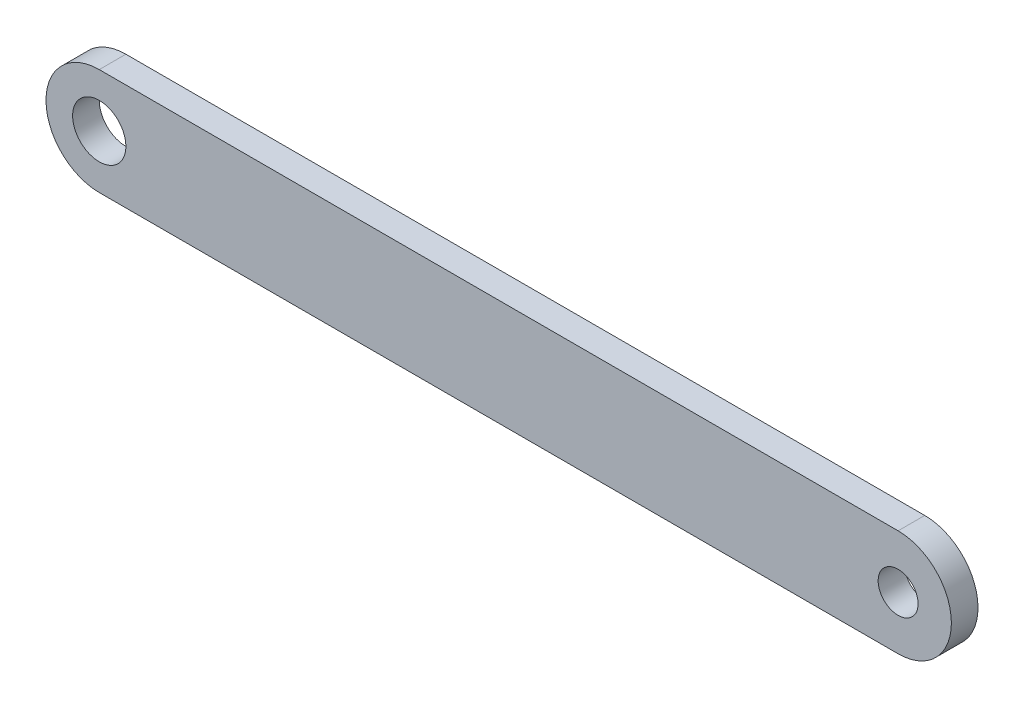
ISO-10303-21;
HEADER;
FILE_DESCRIPTION(('STEP AP214'),'2;1');
FILE_NAME('part.step','',(''),(''),'','','');
FILE_SCHEMA(('AUTOMOTIVE_DESIGN { 1 0 10303 214 1 1 1 1 }'));
ENDSEC;
DATA;
#1=APPLICATION_CONTEXT('core data for automotive mechanical design processes');
#2=APPLICATION_PROTOCOL_DEFINITION('international standard','automotive_design',2000,#1);
#3=PRODUCT_CONTEXT('',#1,'mechanical');
#4=PRODUCT('Part','Part','',(#3));
#5=PRODUCT_RELATED_PRODUCT_CATEGORY('part','',(#4));
#6=PRODUCT_DEFINITION_FORMATION('','',#4);
#7=PRODUCT_DEFINITION_CONTEXT('part definition',#1,'design');
#8=PRODUCT_DEFINITION('design','',#6,#7);
#9=PRODUCT_DEFINITION_SHAPE('','',#8);
#10=(LENGTH_UNIT() NAMED_UNIT(*) SI_UNIT(.MILLI.,.METRE.));
#11=(NAMED_UNIT(*) PLANE_ANGLE_UNIT() SI_UNIT($,.RADIAN.));
#12=(NAMED_UNIT(*) SI_UNIT($,.STERADIAN.) SOLID_ANGLE_UNIT());
#13=UNCERTAINTY_MEASURE_WITH_UNIT(LENGTH_MEASURE(1.E-05),#10,'distance_accuracy_value','');
#14=(GEOMETRIC_REPRESENTATION_CONTEXT(3) GLOBAL_UNCERTAINTY_ASSIGNED_CONTEXT((#13)) GLOBAL_UNIT_ASSIGNED_CONTEXT((#10,
#11,#12)) REPRESENTATION_CONTEXT('',''));
#15=CARTESIAN_POINT('',(0.,0.,0.));
#16=DIRECTION('',(0.,0.,1.));
#17=DIRECTION('',(1.,0.,0.));
#18=AXIS2_PLACEMENT_3D('',#15,#16,#17);
#19=CARTESIAN_POINT('',(-150.,0.,5.));
#20=DIRECTION('',(0.,0.,-1.));
#21=DIRECTION('',(-1.,0.,0.));
#22=AXIS2_PLACEMENT_3D('',#19,#20,#21);
#23=CYLINDRICAL_SURFACE('',#22,20.);
#24=CARTESIAN_POINT('',(-150.,0.,-5.));
#25=DIRECTION('',(0.,0.,1.));
#26=DIRECTION('',(1.,0.,0.));
#27=AXIS2_PLACEMENT_3D('',#24,#25,#26);
#28=CIRCLE('',#27,20.);
#29=CARTESIAN_POINT('',(-150.,20.,-5.));
#30=VERTEX_POINT('',#29);
#31=CARTESIAN_POINT('',(-150.,-20.,-5.));
#32=VERTEX_POINT('',#31);
#33=EDGE_CURVE('E111',#30,#32,#28,.T.);
#34=ORIENTED_EDGE('',*,*,#33,.T.);
#35=DIRECTION('',(0.,0.,-1.));
#36=VECTOR('',#35,1.);
#37=CARTESIAN_POINT('',(-150.,-20.,5.));
#38=LINE('',#37,#36);
#39=CARTESIAN_POINT('',(-150.,-20.,5.));
#40=VERTEX_POINT('',#39);
#41=EDGE_CURVE('E11',#40,#32,#38,.T.);
#42=ORIENTED_EDGE('',*,*,#41,.F.);
#43=CARTESIAN_POINT('',(-150.,0.,5.));
#44=DIRECTION('',(0.,0.,1.));
#45=DIRECTION('',(1.,0.,0.));
#46=AXIS2_PLACEMENT_3D('',#43,#44,#45);
#47=CIRCLE('',#46,20.);
#48=CARTESIAN_POINT('',(-150.,20.,5.));
#49=VERTEX_POINT('',#48);
#50=EDGE_CURVE('E95',#49,#40,#47,.T.);
#51=ORIENTED_EDGE('',*,*,#50,.F.);
#52=DIRECTION('',(0.,0.,-1.));
#53=VECTOR('',#52,1.);
#54=CARTESIAN_POINT('',(-150.,20.,5.));
#55=LINE('',#54,#53);
#56=EDGE_CURVE('E107',#49,#30,#55,.T.);
#57=ORIENTED_EDGE('',*,*,#56,.T.);
#58=EDGE_LOOP('',(#34,#42,#51,#57));
#59=FACE_BOUND('',#58,.T.);
#60=ADVANCED_FACE('F43',(#59),#23,.T.);
#61=CARTESIAN_POINT('',(-150.,-20.,5.));
#62=DIRECTION('',(0.,1.,0.));
#63=DIRECTION('',(-1.,0.,0.));
#64=AXIS2_PLACEMENT_3D('',#61,#62,#63);
#65=PLANE('',#64);
#66=DIRECTION('',(1.,0.,0.));
#67=VECTOR('',#66,1.);
#68=CARTESIAN_POINT('',(-150.,-20.,-5.));
#69=LINE('',#68,#67);
#70=CARTESIAN_POINT('',(150.,-19.9999999999999,-5.));
#71=VERTEX_POINT('',#70);
#72=EDGE_CURVE('E100',#32,#71,#69,.T.);
#73=ORIENTED_EDGE('',*,*,#72,.T.);
#74=DIRECTION('',(0.,0.,-1.));
#75=VECTOR('',#74,1.);
#76=CARTESIAN_POINT('',(150.,-19.9999999999999,5.));
#77=LINE('',#76,#75);
#78=CARTESIAN_POINT('',(150.,-19.9999999999999,5.));
#79=VERTEX_POINT('',#78);
#80=EDGE_CURVE('E52',#79,#71,#77,.T.);
#81=ORIENTED_EDGE('',*,*,#80,.F.);
#82=DIRECTION('',(1.,0.,0.));
#83=VECTOR('',#82,1.);
#84=CARTESIAN_POINT('',(-150.,-20.,5.));
#85=LINE('',#84,#83);
#86=EDGE_CURVE('E90',#40,#79,#85,.T.);
#87=ORIENTED_EDGE('',*,*,#86,.F.);
#88=ORIENTED_EDGE('',*,*,#41,.T.);
#89=EDGE_LOOP('',(#73,#81,#87,#88));
#90=FACE_BOUND('',#89,.T.);
#91=ADVANCED_FACE('F99',(#90),#65,.F.);
#92=CARTESIAN_POINT('',(150.,0.,5.));
#93=DIRECTION('',(0.,0.,-1.));
#94=DIRECTION('',(-1.,0.,0.));
#95=AXIS2_PLACEMENT_3D('',#92,#93,#94);
#96=CYLINDRICAL_SURFACE('',#95,20.);
#97=CARTESIAN_POINT('',(150.,0.,-5.));
#98=DIRECTION('',(0.,0.,1.));
#99=DIRECTION('',(1.,0.,0.));
#100=AXIS2_PLACEMENT_3D('',#97,#98,#99);
#101=CIRCLE('',#100,20.);
#102=CARTESIAN_POINT('',(150.,20.0000000000001,-5.));
#103=VERTEX_POINT('',#102);
#104=EDGE_CURVE('E77',#71,#103,#101,.T.);
#105=ORIENTED_EDGE('',*,*,#104,.T.);
#106=DIRECTION('',(0.,0.,-1.));
#107=VECTOR('',#106,1.);
#108=CARTESIAN_POINT('',(150.,20.0000000000001,5.));
#109=LINE('',#108,#107);
#110=CARTESIAN_POINT('',(150.,20.0000000000001,5.));
#111=VERTEX_POINT('',#110);
#112=EDGE_CURVE('E102',#111,#103,#109,.T.);
#113=ORIENTED_EDGE('',*,*,#112,.F.);
#114=CARTESIAN_POINT('',(150.,0.,5.));
#115=DIRECTION('',(0.,0.,1.));
#116=DIRECTION('',(1.,0.,0.));
#117=AXIS2_PLACEMENT_3D('',#114,#115,#116);
#118=CIRCLE('',#117,20.);
#119=EDGE_CURVE('E93',#79,#111,#118,.T.);
#120=ORIENTED_EDGE('',*,*,#119,.F.);
#121=ORIENTED_EDGE('',*,*,#80,.T.);
#122=EDGE_LOOP('',(#105,#113,#120,#121));
#123=FACE_BOUND('',#122,.T.);
#124=ADVANCED_FACE('F103',(#123),#96,.T.);
#125=CARTESIAN_POINT('',(-150.,20.,5.));
#126=DIRECTION('',(0.,-1.,0.));
#127=DIRECTION('',(1.,0.,0.));
#128=AXIS2_PLACEMENT_3D('',#125,#126,#127);
#129=PLANE('',#128);
#130=DIRECTION('',(-1.,0.,0.));
#131=VECTOR('',#130,1.);
#132=CARTESIAN_POINT('',(-150.,20.,-5.));
#133=LINE('',#132,#131);
#134=EDGE_CURVE('E83',#103,#30,#133,.T.);
#135=ORIENTED_EDGE('',*,*,#134,.T.);
#136=ORIENTED_EDGE('',*,*,#56,.F.);
#137=DIRECTION('',(-1.,0.,0.));
#138=VECTOR('',#137,1.);
#139=CARTESIAN_POINT('',(-150.,20.,5.));
#140=LINE('',#139,#138);
#141=EDGE_CURVE('E60',#111,#49,#140,.T.);
#142=ORIENTED_EDGE('',*,*,#141,.F.);
#143=ORIENTED_EDGE('',*,*,#112,.T.);
#144=EDGE_LOOP('',(#135,#136,#142,#143));
#145=FACE_BOUND('',#144,.T.);
#146=ADVANCED_FACE('F125',(#145),#129,.F.);
#147=CARTESIAN_POINT('',(-150.,0.,5.));
#148=DIRECTION('',(0.,0.,1.));
#149=DIRECTION('',(1.,0.,0.));
#150=AXIS2_PLACEMENT_3D('',#147,#148,#149);
#151=PLANE('',#150);
#152=CARTESIAN_POINT('',(-150.,0.,5.));
#153=DIRECTION('',(0.,0.,1.));
#154=DIRECTION('',(1.,0.,0.));
#155=AXIS2_PLACEMENT_3D('',#152,#153,#154);
#156=CIRCLE('',#155,10.);
#157=CARTESIAN_POINT('',(-140.,0.,5.));
#158=VERTEX_POINT('',#157);
#159=EDGE_CURVE('E140',#158,#158,#156,.T.);
#160=ORIENTED_EDGE('',*,*,#159,.F.);
#161=EDGE_LOOP('',(#160));
#162=FACE_BOUND('',#161,.T.);
#163=CARTESIAN_POINT('',(150.,0.,5.));
#164=DIRECTION('',(0.,0.,1.));
#165=DIRECTION('',(1.,0.,0.));
#166=AXIS2_PLACEMENT_3D('',#163,#164,#165);
#167=CIRCLE('',#166,7.50000000000001);
#168=CARTESIAN_POINT('',(157.5,0.,5.));
#169=VERTEX_POINT('',#168);
#170=EDGE_CURVE('E136',#169,#169,#167,.T.);
#171=ORIENTED_EDGE('',*,*,#170,.F.);
#172=EDGE_LOOP('',(#171));
#173=FACE_BOUND('',#172,.T.);
#174=ORIENTED_EDGE('',*,*,#50,.T.);
#175=ORIENTED_EDGE('',*,*,#86,.T.);
#176=ORIENTED_EDGE('',*,*,#119,.T.);
#177=ORIENTED_EDGE('',*,*,#141,.T.);
#178=EDGE_LOOP('',(#174,#175,#176,#177));
#179=FACE_BOUND('',#178,.T.);
#180=ADVANCED_FACE('F91',(#162,#173,#179),#151,.T.);
#181=CARTESIAN_POINT('',(-150.,0.,-5.));
#182=DIRECTION('',(0.,0.,1.));
#183=DIRECTION('',(1.,0.,0.));
#184=AXIS2_PLACEMENT_3D('',#181,#182,#183);
#185=PLANE('',#184);
#186=CARTESIAN_POINT('',(-150.,0.,-5.));
#187=DIRECTION('',(0.,0.,1.));
#188=DIRECTION('',(1.,0.,0.));
#189=AXIS2_PLACEMENT_3D('',#186,#187,#188);
#190=CIRCLE('',#189,10.);
#191=CARTESIAN_POINT('',(-140.,0.,-5.));
#192=VERTEX_POINT('',#191);
#193=EDGE_CURVE('E115',#192,#192,#190,.T.);
#194=ORIENTED_EDGE('',*,*,#193,.T.);
#195=EDGE_LOOP('',(#194));
#196=FACE_BOUND('',#195,.T.);
#197=CARTESIAN_POINT('',(150.,0.,-5.));
#198=DIRECTION('',(0.,0.,1.));
#199=DIRECTION('',(1.,0.,0.));
#200=AXIS2_PLACEMENT_3D('',#197,#198,#199);
#201=CIRCLE('',#200,7.50000000000001);
#202=CARTESIAN_POINT('',(157.5,0.,-5.));
#203=VERTEX_POINT('',#202);
#204=EDGE_CURVE('E132',#203,#203,#201,.T.);
#205=ORIENTED_EDGE('',*,*,#204,.T.);
#206=EDGE_LOOP('',(#205));
#207=FACE_BOUND('',#206,.T.);
#208=ORIENTED_EDGE('',*,*,#33,.F.);
#209=ORIENTED_EDGE('',*,*,#134,.F.);
#210=ORIENTED_EDGE('',*,*,#104,.F.);
#211=ORIENTED_EDGE('',*,*,#72,.F.);
#212=EDGE_LOOP('',(#208,#209,#210,#211));
#213=FACE_BOUND('',#212,.T.);
#214=ADVANCED_FACE('F128',(#196,#207,#213),#185,.F.);
#215=CARTESIAN_POINT('',(150.,0.,-5.));
#216=DIRECTION('',(0.,0.,1.));
#217=DIRECTION('',(1.,0.,0.));
#218=AXIS2_PLACEMENT_3D('',#215,#216,#217);
#219=CYLINDRICAL_SURFACE('',#218,7.50000000000001);
#220=ORIENTED_EDGE('',*,*,#204,.F.);
#221=EDGE_LOOP('',(#220));
#222=FACE_BOUND('',#221,.T.);
#223=ORIENTED_EDGE('',*,*,#170,.T.);
#224=EDGE_LOOP('',(#223));
#225=FACE_BOUND('',#224,.T.);
#226=ADVANCED_FACE('F153',(#222,#225),#219,.F.);
#227=CARTESIAN_POINT('',(-150.,0.,-5.));
#228=DIRECTION('',(0.,0.,1.));
#229=DIRECTION('',(1.,0.,0.));
#230=AXIS2_PLACEMENT_3D('',#227,#228,#229);
#231=CYLINDRICAL_SURFACE('',#230,10.);
#232=ORIENTED_EDGE('',*,*,#193,.F.);
#233=EDGE_LOOP('',(#232));
#234=FACE_BOUND('',#233,.T.);
#235=ORIENTED_EDGE('',*,*,#159,.T.);
#236=EDGE_LOOP('',(#235));
#237=FACE_BOUND('',#236,.T.);
#238=ADVANCED_FACE('F150',(#234,#237),#231,.F.);
#239=CLOSED_SHELL('',(#60,#91,#124,#146,#180,#214,#226,#238));
#240=MANIFOLD_SOLID_BREP('B2',#239);
#241=ADVANCED_BREP_SHAPE_REPRESENTATION('',(#18,#240),#14);
#242=SHAPE_DEFINITION_REPRESENTATION(#9,#241);
ENDSEC;
END-ISO-10303-21;
